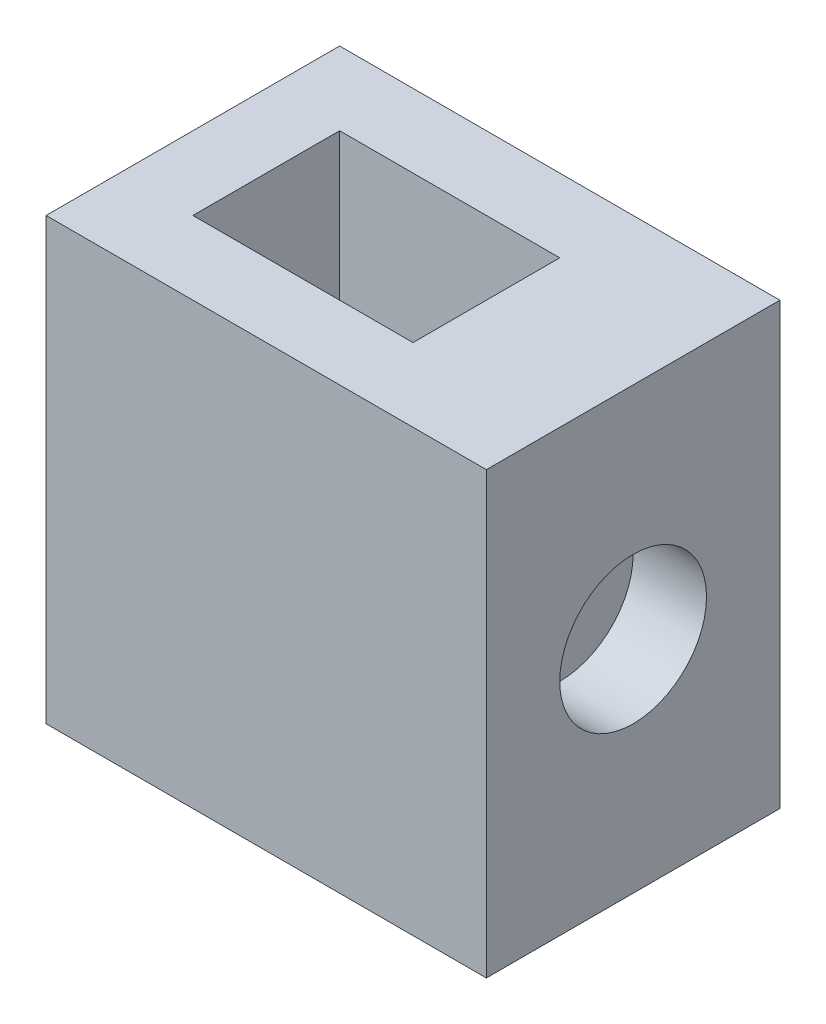
ISO-10303-21;
HEADER;
FILE_DESCRIPTION(('STEP AP214'),'2;1');
FILE_NAME('part.step','',(''),(''),'','','');
FILE_SCHEMA(('AUTOMOTIVE_DESIGN { 1 0 10303 214 1 1 1 1 }'));
ENDSEC;
DATA;
#1=APPLICATION_CONTEXT('core data for automotive mechanical design processes');
#2=APPLICATION_PROTOCOL_DEFINITION('international standard','automotive_design',2000,#1);
#3=PRODUCT_CONTEXT('',#1,'mechanical');
#4=PRODUCT('Part','Part','',(#3));
#5=PRODUCT_RELATED_PRODUCT_CATEGORY('part','',(#4));
#6=PRODUCT_DEFINITION_FORMATION('','',#4);
#7=PRODUCT_DEFINITION_CONTEXT('part definition',#1,'design');
#8=PRODUCT_DEFINITION('design','',#6,#7);
#9=PRODUCT_DEFINITION_SHAPE('','',#8);
#10=(LENGTH_UNIT() NAMED_UNIT(*) SI_UNIT(.MILLI.,.METRE.));
#11=(NAMED_UNIT(*) PLANE_ANGLE_UNIT() SI_UNIT($,.RADIAN.));
#12=(NAMED_UNIT(*) SI_UNIT($,.STERADIAN.) SOLID_ANGLE_UNIT());
#13=UNCERTAINTY_MEASURE_WITH_UNIT(LENGTH_MEASURE(1.E-05),#10,'distance_accuracy_value','');
#14=(GEOMETRIC_REPRESENTATION_CONTEXT(3) GLOBAL_UNCERTAINTY_ASSIGNED_CONTEXT((#13)) GLOBAL_UNIT_ASSIGNED_CONTEXT((#10,
#11,#12)) REPRESENTATION_CONTEXT('',''));
#15=CARTESIAN_POINT('',(0.,0.,0.));
#16=DIRECTION('',(0.,0.,1.));
#17=DIRECTION('',(1.,0.,0.));
#18=AXIS2_PLACEMENT_3D('',#15,#16,#17);
#19=CARTESIAN_POINT('',(0.,76.2,0.));
#20=DIRECTION('',(1.,0.,0.));
#21=DIRECTION('',(0.,0.,-1.));
#22=AXIS2_PLACEMENT_3D('',#19,#20,#21);
#23=PLANE('',#22);
#24=DIRECTION('',(0.,0.,1.));
#25=VECTOR('',#24,1.);
#26=CARTESIAN_POINT('',(0.,0.,0.));
#27=LINE('',#26,#25);
#28=CARTESIAN_POINT('',(0.,0.,-50.8));
#29=VERTEX_POINT('',#28);
#30=CARTESIAN_POINT('',(0.,0.,0.));
#31=VERTEX_POINT('',#30);
#32=EDGE_CURVE('E148',#29,#31,#27,.T.);
#33=ORIENTED_EDGE('',*,*,#32,.T.);
#34=DIRECTION('',(0.,-1.,0.));
#35=VECTOR('',#34,1.);
#36=CARTESIAN_POINT('',(0.,76.2,0.));
#37=LINE('',#36,#35);
#38=CARTESIAN_POINT('',(0.,76.2,0.));
#39=VERTEX_POINT('',#38);
#40=EDGE_CURVE('E11',#39,#31,#37,.T.);
#41=ORIENTED_EDGE('',*,*,#40,.F.);
#42=DIRECTION('',(0.,0.,1.));
#43=VECTOR('',#42,1.);
#44=CARTESIAN_POINT('',(0.,76.2,0.));
#45=LINE('',#44,#43);
#46=CARTESIAN_POINT('',(0.,76.2,-50.8));
#47=VERTEX_POINT('',#46);
#48=EDGE_CURVE('E152',#47,#39,#45,.T.);
#49=ORIENTED_EDGE('',*,*,#48,.F.);
#50=DIRECTION('',(0.,-1.,0.));
#51=VECTOR('',#50,1.);
#52=CARTESIAN_POINT('',(0.,76.2,-50.8));
#53=LINE('',#52,#51);
#54=EDGE_CURVE('E158',#47,#29,#53,.T.);
#55=ORIENTED_EDGE('',*,*,#54,.T.);
#56=EDGE_LOOP('',(#33,#41,#49,#55));
#57=FACE_BOUND('',#56,.T.);
#58=ADVANCED_FACE('F36',(#57),#23,.F.);
#59=CARTESIAN_POINT('',(0.,76.2,0.));
#60=DIRECTION('',(0.,0.,-1.));
#61=DIRECTION('',(-1.,0.,0.));
#62=AXIS2_PLACEMENT_3D('',#59,#60,#61);
#63=PLANE('',#62);
#64=DIRECTION('',(1.,0.,0.));
#65=VECTOR('',#64,1.);
#66=CARTESIAN_POINT('',(0.,0.,0.));
#67=LINE('',#66,#65);
#68=CARTESIAN_POINT('',(76.2,0.,0.));
#69=VERTEX_POINT('',#68);
#70=EDGE_CURVE('E161',#31,#69,#67,.T.);
#71=ORIENTED_EDGE('',*,*,#70,.T.);
#72=DIRECTION('',(0.,-1.,0.));
#73=VECTOR('',#72,1.);
#74=CARTESIAN_POINT('',(76.2,76.2,0.));
#75=LINE('',#74,#73);
#76=CARTESIAN_POINT('',(76.2,76.2,0.));
#77=VERTEX_POINT('',#76);
#78=EDGE_CURVE('E43',#77,#69,#75,.T.);
#79=ORIENTED_EDGE('',*,*,#78,.F.);
#80=DIRECTION('',(1.,0.,0.));
#81=VECTOR('',#80,1.);
#82=CARTESIAN_POINT('',(0.,76.2,0.));
#83=LINE('',#82,#81);
#84=EDGE_CURVE('E87',#39,#77,#83,.T.);
#85=ORIENTED_EDGE('',*,*,#84,.F.);
#86=ORIENTED_EDGE('',*,*,#40,.T.);
#87=EDGE_LOOP('',(#71,#79,#85,#86));
#88=FACE_BOUND('',#87,.T.);
#89=ADVANCED_FACE('F190',(#88),#63,.F.);
#90=CARTESIAN_POINT('',(76.2,76.2,0.));
#91=DIRECTION('',(-1.,0.,0.));
#92=DIRECTION('',(0.,0.,1.));
#93=AXIS2_PLACEMENT_3D('',#90,#91,#92);
#94=PLANE('',#93);
#95=CARTESIAN_POINT('',(76.2,38.1,-25.4));
#96=DIRECTION('',(1.,0.,0.));
#97=DIRECTION('',(0.,0.,-1.));
#98=AXIS2_PLACEMENT_3D('',#95,#96,#97);
#99=CIRCLE('',#98,12.7);
#100=CARTESIAN_POINT('',(76.2,38.1,-38.1));
#101=VERTEX_POINT('',#100);
#102=EDGE_CURVE('E135',#101,#101,#99,.T.);
#103=ORIENTED_EDGE('',*,*,#102,.F.);
#104=EDGE_LOOP('',(#103));
#105=FACE_BOUND('',#104,.T.);
#106=DIRECTION('',(0.,0.,-1.));
#107=VECTOR('',#106,1.);
#108=CARTESIAN_POINT('',(76.2,0.,0.));
#109=LINE('',#108,#107);
#110=CARTESIAN_POINT('',(76.2,0.,-50.8));
#111=VERTEX_POINT('',#110);
#112=EDGE_CURVE('E163',#69,#111,#109,.T.);
#113=ORIENTED_EDGE('',*,*,#112,.T.);
#114=DIRECTION('',(0.,-1.,0.));
#115=VECTOR('',#114,1.);
#116=CARTESIAN_POINT('',(76.2,76.2,-50.8));
#117=LINE('',#116,#115);
#118=CARTESIAN_POINT('',(76.2,76.2,-50.8));
#119=VERTEX_POINT('',#118);
#120=EDGE_CURVE('E167',#119,#111,#117,.T.);
#121=ORIENTED_EDGE('',*,*,#120,.F.);
#122=DIRECTION('',(0.,0.,-1.));
#123=VECTOR('',#122,1.);
#124=CARTESIAN_POINT('',(76.2,76.2,0.));
#125=LINE('',#124,#123);
#126=EDGE_CURVE('E155',#77,#119,#125,.T.);
#127=ORIENTED_EDGE('',*,*,#126,.F.);
#128=ORIENTED_EDGE('',*,*,#78,.T.);
#129=EDGE_LOOP('',(#113,#121,#127,#128));
#130=FACE_BOUND('',#129,.T.);
#131=ADVANCED_FACE('F172',(#105,#130),#94,.F.);
#132=CARTESIAN_POINT('',(0.,76.2,-50.8));
#133=DIRECTION('',(0.,0.,1.));
#134=DIRECTION('',(1.,0.,0.));
#135=AXIS2_PLACEMENT_3D('',#132,#133,#134);
#136=PLANE('',#135);
#137=DIRECTION('',(-1.,0.,0.));
#138=VECTOR('',#137,1.);
#139=CARTESIAN_POINT('',(0.,0.,-50.8));
#140=LINE('',#139,#138);
#141=EDGE_CURVE('E80',#111,#29,#140,.T.);
#142=ORIENTED_EDGE('',*,*,#141,.T.);
#143=ORIENTED_EDGE('',*,*,#54,.F.);
#144=DIRECTION('',(-1.,0.,0.));
#145=VECTOR('',#144,1.);
#146=CARTESIAN_POINT('',(0.,76.2,-50.8));
#147=LINE('',#146,#145);
#148=EDGE_CURVE('E59',#119,#47,#147,.T.);
#149=ORIENTED_EDGE('',*,*,#148,.F.);
#150=ORIENTED_EDGE('',*,*,#120,.T.);
#151=EDGE_LOOP('',(#142,#143,#149,#150));
#152=FACE_BOUND('',#151,.T.);
#153=ADVANCED_FACE('F180',(#152),#136,.F.);
#154=CARTESIAN_POINT('',(0.,76.2,0.));
#155=DIRECTION('',(0.,-1.,0.));
#156=DIRECTION('',(0.,0.,-1.));
#157=AXIS2_PLACEMENT_3D('',#154,#155,#156);
#158=PLANE('',#157);
#159=DIRECTION('',(1.,0.,0.));
#160=VECTOR('',#159,1.);
#161=CARTESIAN_POINT('',(12.7,76.2,-12.7));
#162=LINE('',#161,#160);
#163=CARTESIAN_POINT('',(12.7,76.2,-12.7));
#164=VERTEX_POINT('',#163);
#165=CARTESIAN_POINT('',(50.8,76.2,-12.7));
#166=VERTEX_POINT('',#165);
#167=EDGE_CURVE('E141',#164,#166,#162,.T.);
#168=ORIENTED_EDGE('',*,*,#167,.F.);
#169=DIRECTION('',(0.,0.,1.));
#170=VECTOR('',#169,1.);
#171=CARTESIAN_POINT('',(12.7,76.2,-38.1));
#172=LINE('',#171,#170);
#173=CARTESIAN_POINT('',(12.7,76.2,-38.1));
#174=VERTEX_POINT('',#173);
#175=EDGE_CURVE('E50',#174,#164,#172,.T.);
#176=ORIENTED_EDGE('',*,*,#175,.F.);
#177=DIRECTION('',(-1.,0.,0.));
#178=VECTOR('',#177,1.);
#179=CARTESIAN_POINT('',(12.7,76.2,-38.1));
#180=LINE('',#179,#178);
#181=CARTESIAN_POINT('',(50.8,76.2,-38.1));
#182=VERTEX_POINT('',#181);
#183=EDGE_CURVE('E129',#182,#174,#180,.T.);
#184=ORIENTED_EDGE('',*,*,#183,.F.);
#185=DIRECTION('',(0.,0.,-1.));
#186=VECTOR('',#185,1.);
#187=CARTESIAN_POINT('',(50.8,76.2,-38.1));
#188=LINE('',#187,#186);
#189=EDGE_CURVE('E132',#166,#182,#188,.T.);
#190=ORIENTED_EDGE('',*,*,#189,.F.);
#191=EDGE_LOOP('',(#168,#176,#184,#190));
#192=FACE_BOUND('',#191,.T.);
#193=ORIENTED_EDGE('',*,*,#48,.T.);
#194=ORIENTED_EDGE('',*,*,#84,.T.);
#195=ORIENTED_EDGE('',*,*,#126,.T.);
#196=ORIENTED_EDGE('',*,*,#148,.T.);
#197=EDGE_LOOP('',(#193,#194,#195,#196));
#198=FACE_BOUND('',#197,.T.);
#199=ADVANCED_FACE('F182',(#192,#198),#158,.F.);
#200=CARTESIAN_POINT('',(0.,0.,0.));
#201=DIRECTION('',(0.,-1.,0.));
#202=DIRECTION('',(0.,0.,-1.));
#203=AXIS2_PLACEMENT_3D('',#200,#201,#202);
#204=PLANE('',#203);
#205=ORIENTED_EDGE('',*,*,#32,.F.);
#206=ORIENTED_EDGE('',*,*,#141,.F.);
#207=ORIENTED_EDGE('',*,*,#112,.F.);
#208=ORIENTED_EDGE('',*,*,#70,.F.);
#209=EDGE_LOOP('',(#205,#206,#207,#208));
#210=FACE_BOUND('',#209,.T.);
#211=ADVANCED_FACE('F176',(#210),#204,.T.);
#212=CARTESIAN_POINT('',(12.7,50.8,-38.1));
#213=DIRECTION('',(-1.,0.,0.));
#214=DIRECTION('',(0.,0.,1.));
#215=AXIS2_PLACEMENT_3D('',#212,#213,#214);
#216=PLANE('',#215);
#217=ORIENTED_EDGE('',*,*,#175,.T.);
#218=DIRECTION('',(0.,1.,0.));
#219=VECTOR('',#218,1.);
#220=CARTESIAN_POINT('',(12.7,50.8,-12.7));
#221=LINE('',#220,#219);
#222=CARTESIAN_POINT('',(12.7,50.8,-12.7));
#223=VERTEX_POINT('',#222);
#224=EDGE_CURVE('E107',#223,#164,#221,.T.);
#225=ORIENTED_EDGE('',*,*,#224,.F.);
#226=DIRECTION('',(0.,0.,1.));
#227=VECTOR('',#226,1.);
#228=CARTESIAN_POINT('',(12.7,50.8,-38.1));
#229=LINE('',#228,#227);
#230=CARTESIAN_POINT('',(12.7,50.8,-38.1));
#231=VERTEX_POINT('',#230);
#232=EDGE_CURVE('E111',#231,#223,#229,.T.);
#233=ORIENTED_EDGE('',*,*,#232,.F.);
#234=DIRECTION('',(0.,1.,0.));
#235=VECTOR('',#234,1.);
#236=CARTESIAN_POINT('',(12.7,50.8,-38.1));
#237=LINE('',#236,#235);
#238=EDGE_CURVE('E146',#231,#174,#237,.T.);
#239=ORIENTED_EDGE('',*,*,#238,.T.);
#240=EDGE_LOOP('',(#217,#225,#233,#239));
#241=FACE_BOUND('',#240,.T.);
#242=ADVANCED_FACE('F109',(#241),#216,.F.);
#243=CARTESIAN_POINT('',(12.7,50.8,-38.1));
#244=DIRECTION('',(0.,0.,-1.));
#245=DIRECTION('',(-1.,0.,0.));
#246=AXIS2_PLACEMENT_3D('',#243,#244,#245);
#247=PLANE('',#246);
#248=ORIENTED_EDGE('',*,*,#183,.T.);
#249=ORIENTED_EDGE('',*,*,#238,.F.);
#250=DIRECTION('',(-1.,0.,0.));
#251=VECTOR('',#250,1.);
#252=CARTESIAN_POINT('',(12.7,50.8,-38.1));
#253=LINE('',#252,#251);
#254=CARTESIAN_POINT('',(50.8,50.8,-38.1));
#255=VERTEX_POINT('',#254);
#256=EDGE_CURVE('E117',#255,#231,#253,.T.);
#257=ORIENTED_EDGE('',*,*,#256,.F.);
#258=DIRECTION('',(0.,1.,0.));
#259=VECTOR('',#258,1.);
#260=CARTESIAN_POINT('',(50.8,50.8,-38.1));
#261=LINE('',#260,#259);
#262=EDGE_CURVE('E149',#255,#182,#261,.T.);
#263=ORIENTED_EDGE('',*,*,#262,.T.);
#264=EDGE_LOOP('',(#248,#249,#257,#263));
#265=FACE_BOUND('',#264,.T.);
#266=ADVANCED_FACE('F237',(#265),#247,.F.);
#267=CARTESIAN_POINT('',(50.8,50.8,-38.1));
#268=DIRECTION('',(1.,0.,0.));
#269=DIRECTION('',(0.,0.,-1.));
#270=AXIS2_PLACEMENT_3D('',#267,#268,#269);
#271=PLANE('',#270);
#272=ORIENTED_EDGE('',*,*,#189,.T.);
#273=ORIENTED_EDGE('',*,*,#262,.F.);
#274=DIRECTION('',(0.,0.,-1.));
#275=VECTOR('',#274,1.);
#276=CARTESIAN_POINT('',(50.8,50.8,-38.1));
#277=LINE('',#276,#275);
#278=CARTESIAN_POINT('',(50.8,50.8,-12.7));
#279=VERTEX_POINT('',#278);
#280=EDGE_CURVE('E125',#279,#255,#277,.T.);
#281=ORIENTED_EDGE('',*,*,#280,.F.);
#282=DIRECTION('',(0.,1.,0.));
#283=VECTOR('',#282,1.);
#284=CARTESIAN_POINT('',(50.8,50.8,-12.7));
#285=LINE('',#284,#283);
#286=EDGE_CURVE('E116',#279,#166,#285,.T.);
#287=ORIENTED_EDGE('',*,*,#286,.T.);
#288=EDGE_LOOP('',(#272,#273,#281,#287));
#289=FACE_BOUND('',#288,.T.);
#290=ADVANCED_FACE('F240',(#289),#271,.F.);
#291=CARTESIAN_POINT('',(12.7,50.8,-12.7));
#292=DIRECTION('',(0.,0.,1.));
#293=DIRECTION('',(1.,0.,0.));
#294=AXIS2_PLACEMENT_3D('',#291,#292,#293);
#295=PLANE('',#294);
#296=ORIENTED_EDGE('',*,*,#167,.T.);
#297=ORIENTED_EDGE('',*,*,#286,.F.);
#298=DIRECTION('',(1.,0.,0.));
#299=VECTOR('',#298,1.);
#300=CARTESIAN_POINT('',(12.7,50.8,-12.7));
#301=LINE('',#300,#299);
#302=EDGE_CURVE('E120',#223,#279,#301,.T.);
#303=ORIENTED_EDGE('',*,*,#302,.F.);
#304=ORIENTED_EDGE('',*,*,#224,.T.);
#305=EDGE_LOOP('',(#296,#297,#303,#304));
#306=FACE_BOUND('',#305,.T.);
#307=ADVANCED_FACE('F121',(#306),#295,.F.);
#308=CARTESIAN_POINT('',(0.,50.8,0.));
#309=DIRECTION('',(0.,1.,0.));
#310=DIRECTION('',(0.,0.,1.));
#311=AXIS2_PLACEMENT_3D('',#308,#309,#310);
#312=PLANE('',#311);
#313=ORIENTED_EDGE('',*,*,#232,.T.);
#314=ORIENTED_EDGE('',*,*,#302,.T.);
#315=ORIENTED_EDGE('',*,*,#280,.T.);
#316=ORIENTED_EDGE('',*,*,#256,.T.);
#317=EDGE_LOOP('',(#313,#314,#315,#316));
#318=FACE_BOUND('',#317,.T.);
#319=ADVANCED_FACE('F127',(#318),#312,.T.);
#320=CARTESIAN_POINT('',(63.5,38.1,-25.4));
#321=DIRECTION('',(1.,0.,0.));
#322=DIRECTION('',(0.,0.,-1.));
#323=AXIS2_PLACEMENT_3D('',#320,#321,#322);
#324=CYLINDRICAL_SURFACE('',#323,12.7);
#325=CARTESIAN_POINT('',(63.5,38.1,-25.4));
#326=DIRECTION('',(1.,0.,0.));
#327=DIRECTION('',(0.,0.,-1.));
#328=AXIS2_PLACEMENT_3D('',#325,#326,#327);
#329=CIRCLE('',#328,12.7);
#330=CARTESIAN_POINT('',(63.5,38.1,-38.1));
#331=VERTEX_POINT('',#330);
#332=EDGE_CURVE('E142',#331,#331,#329,.T.);
#333=ORIENTED_EDGE('',*,*,#332,.F.);
#334=EDGE_LOOP('',(#333));
#335=FACE_BOUND('',#334,.T.);
#336=ORIENTED_EDGE('',*,*,#102,.T.);
#337=EDGE_LOOP('',(#336));
#338=FACE_BOUND('',#337,.T.);
#339=ADVANCED_FACE('F215',(#335,#338),#324,.F.);
#340=CARTESIAN_POINT('',(63.5,38.1,-25.4));
#341=DIRECTION('',(1.,0.,0.));
#342=DIRECTION('',(0.,0.,-1.));
#343=AXIS2_PLACEMENT_3D('',#340,#341,#342);
#344=PLANE('',#343);
#345=ORIENTED_EDGE('',*,*,#332,.T.);
#346=EDGE_LOOP('',(#345));
#347=FACE_BOUND('',#346,.T.);
#348=ADVANCED_FACE('F220',(#347),#344,.T.);
#349=CLOSED_SHELL('',(#58,#89,#131,#153,#199,#211,#242,#266,#290,#307,#319,#339,#348));
#350=MANIFOLD_SOLID_BREP('B2',#349);
#351=ADVANCED_BREP_SHAPE_REPRESENTATION('',(#18,#350),#14);
#352=SHAPE_DEFINITION_REPRESENTATION(#9,#351);
ENDSEC;
END-ISO-10303-21;
